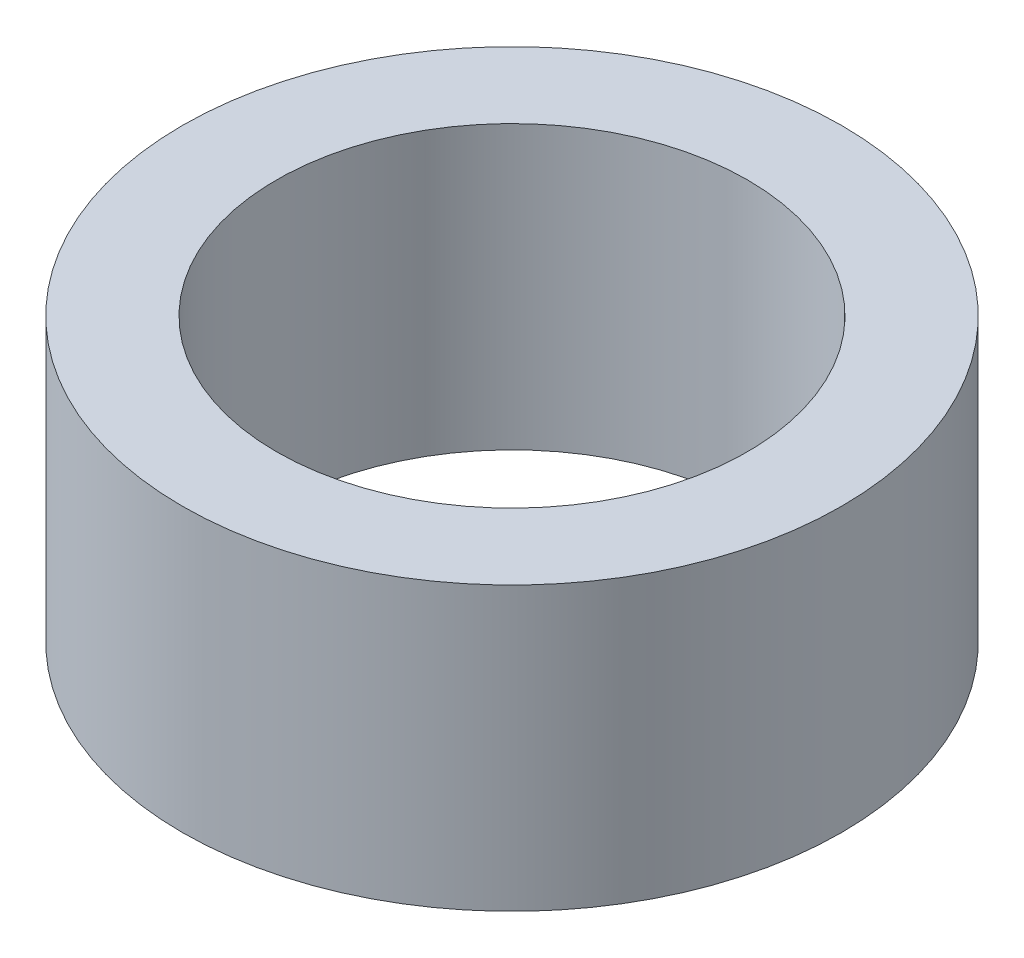
ISO-10303-21;
HEADER;
FILE_DESCRIPTION(('STEP AP214'),'2;1');
FILE_NAME('part.step','',(''),(''),'','','');
FILE_SCHEMA(('AUTOMOTIVE_DESIGN { 1 0 10303 214 1 1 1 1 }'));
ENDSEC;
DATA;
#1=APPLICATION_CONTEXT('core data for automotive mechanical design processes');
#2=APPLICATION_PROTOCOL_DEFINITION('international standard','automotive_design',2000,#1);
#3=PRODUCT_CONTEXT('',#1,'mechanical');
#4=PRODUCT('Part','Part','',(#3));
#5=PRODUCT_RELATED_PRODUCT_CATEGORY('part','',(#4));
#6=PRODUCT_DEFINITION_FORMATION('','',#4);
#7=PRODUCT_DEFINITION_CONTEXT('part definition',#1,'design');
#8=PRODUCT_DEFINITION('design','',#6,#7);
#9=PRODUCT_DEFINITION_SHAPE('','',#8);
#10=(LENGTH_UNIT() NAMED_UNIT(*) SI_UNIT(.MILLI.,.METRE.));
#11=(NAMED_UNIT(*) PLANE_ANGLE_UNIT() SI_UNIT($,.RADIAN.));
#12=(NAMED_UNIT(*) SI_UNIT($,.STERADIAN.) SOLID_ANGLE_UNIT());
#13=UNCERTAINTY_MEASURE_WITH_UNIT(LENGTH_MEASURE(1.E-05),#10,'distance_accuracy_value','');
#14=(GEOMETRIC_REPRESENTATION_CONTEXT(3) GLOBAL_UNCERTAINTY_ASSIGNED_CONTEXT((#13)) GLOBAL_UNIT_ASSIGNED_CONTEXT((#10,
#11,#12)) REPRESENTATION_CONTEXT('',''));
#15=CARTESIAN_POINT('',(0.,0.,0.));
#16=DIRECTION('',(0.,0.,1.));
#17=DIRECTION('',(1.,0.,0.));
#18=AXIS2_PLACEMENT_3D('',#15,#16,#17);
#19=CARTESIAN_POINT('',(0.,15.,0.));
#20=DIRECTION('',(0.,1.,0.));
#21=DIRECTION('',(0.,0.,1.));
#22=AXIS2_PLACEMENT_3D('',#19,#20,#21);
#23=PLANE('',#22);
#24=CARTESIAN_POINT('',(0.,15.,0.));
#25=DIRECTION('',(0.,1.,0.));
#26=DIRECTION('',(0.,0.,1.));
#27=AXIS2_PLACEMENT_3D('',#24,#25,#26);
#28=CIRCLE('',#27,17.5);
#29=CARTESIAN_POINT('',(0.,15.,17.5));
#30=VERTEX_POINT('',#29);
#31=EDGE_CURVE('E10',#30,#30,#28,.T.);
#32=ORIENTED_EDGE('',*,*,#31,.T.);
#33=EDGE_LOOP('',(#32));
#34=FACE_BOUND('',#33,.T.);
#35=CARTESIAN_POINT('',(0.,15.,0.));
#36=DIRECTION('',(0.,1.,0.));
#37=DIRECTION('',(0.,0.,1.));
#38=AXIS2_PLACEMENT_3D('',#35,#36,#37);
#39=CIRCLE('',#38,12.5);
#40=CARTESIAN_POINT('',(0.,15.,12.5));
#41=VERTEX_POINT('',#40);
#42=EDGE_CURVE('E45',#41,#41,#39,.T.);
#43=ORIENTED_EDGE('',*,*,#42,.F.);
#44=EDGE_LOOP('',(#43));
#45=FACE_BOUND('',#44,.T.);
#46=ADVANCED_FACE('F34',(#34,#45),#23,.T.);
#47=CARTESIAN_POINT('',(0.,0.,0.));
#48=DIRECTION('',(0.,1.,0.));
#49=DIRECTION('',(0.,0.,1.));
#50=AXIS2_PLACEMENT_3D('',#47,#48,#49);
#51=PLANE('',#50);
#52=CARTESIAN_POINT('',(0.,0.,0.));
#53=DIRECTION('',(0.,1.,0.));
#54=DIRECTION('',(0.,0.,1.));
#55=AXIS2_PLACEMENT_3D('',#52,#53,#54);
#56=CIRCLE('',#55,17.5);
#57=CARTESIAN_POINT('',(0.,0.,17.5));
#58=VERTEX_POINT('',#57);
#59=EDGE_CURVE('E38',#58,#58,#56,.T.);
#60=ORIENTED_EDGE('',*,*,#59,.F.);
#61=EDGE_LOOP('',(#60));
#62=FACE_BOUND('',#61,.T.);
#63=CARTESIAN_POINT('',(0.,0.,0.));
#64=DIRECTION('',(0.,1.,0.));
#65=DIRECTION('',(0.,0.,1.));
#66=AXIS2_PLACEMENT_3D('',#63,#64,#65);
#67=CIRCLE('',#66,12.5);
#68=CARTESIAN_POINT('',(0.,0.,12.5));
#69=VERTEX_POINT('',#68);
#70=EDGE_CURVE('E47',#69,#69,#67,.T.);
#71=ORIENTED_EDGE('',*,*,#70,.T.);
#72=EDGE_LOOP('',(#71));
#73=FACE_BOUND('',#72,.T.);
#74=ADVANCED_FACE('F57',(#62,#73),#51,.F.);
#75=CARTESIAN_POINT('',(0.,15.,0.));
#76=DIRECTION('',(0.,-1.,0.));
#77=DIRECTION('',(0.,0.,-1.));
#78=AXIS2_PLACEMENT_3D('',#75,#76,#77);
#79=CYLINDRICAL_SURFACE('',#78,17.5);
#80=ORIENTED_EDGE('',*,*,#31,.F.);
#81=EDGE_LOOP('',(#80));
#82=FACE_BOUND('',#81,.T.);
#83=ORIENTED_EDGE('',*,*,#59,.T.);
#84=EDGE_LOOP('',(#83));
#85=FACE_BOUND('',#84,.T.);
#86=ADVANCED_FACE('F36',(#82,#85),#79,.T.);
#87=CARTESIAN_POINT('',(0.,15.,0.));
#88=DIRECTION('',(0.,-1.,0.));
#89=DIRECTION('',(0.,0.,-1.));
#90=AXIS2_PLACEMENT_3D('',#87,#88,#89);
#91=CYLINDRICAL_SURFACE('',#90,12.5);
#92=ORIENTED_EDGE('',*,*,#42,.T.);
#93=EDGE_LOOP('',(#92));
#94=FACE_BOUND('',#93,.T.);
#95=ORIENTED_EDGE('',*,*,#70,.F.);
#96=EDGE_LOOP('',(#95));
#97=FACE_BOUND('',#96,.T.);
#98=ADVANCED_FACE('F53',(#94,#97),#91,.F.);
#99=CLOSED_SHELL('',(#46,#74,#86,#98));
#100=MANIFOLD_SOLID_BREP('B2',#99);
#101=ADVANCED_BREP_SHAPE_REPRESENTATION('',(#18,#100),#14);
#102=SHAPE_DEFINITION_REPRESENTATION(#9,#101);
ENDSEC;
END-ISO-10303-21;
